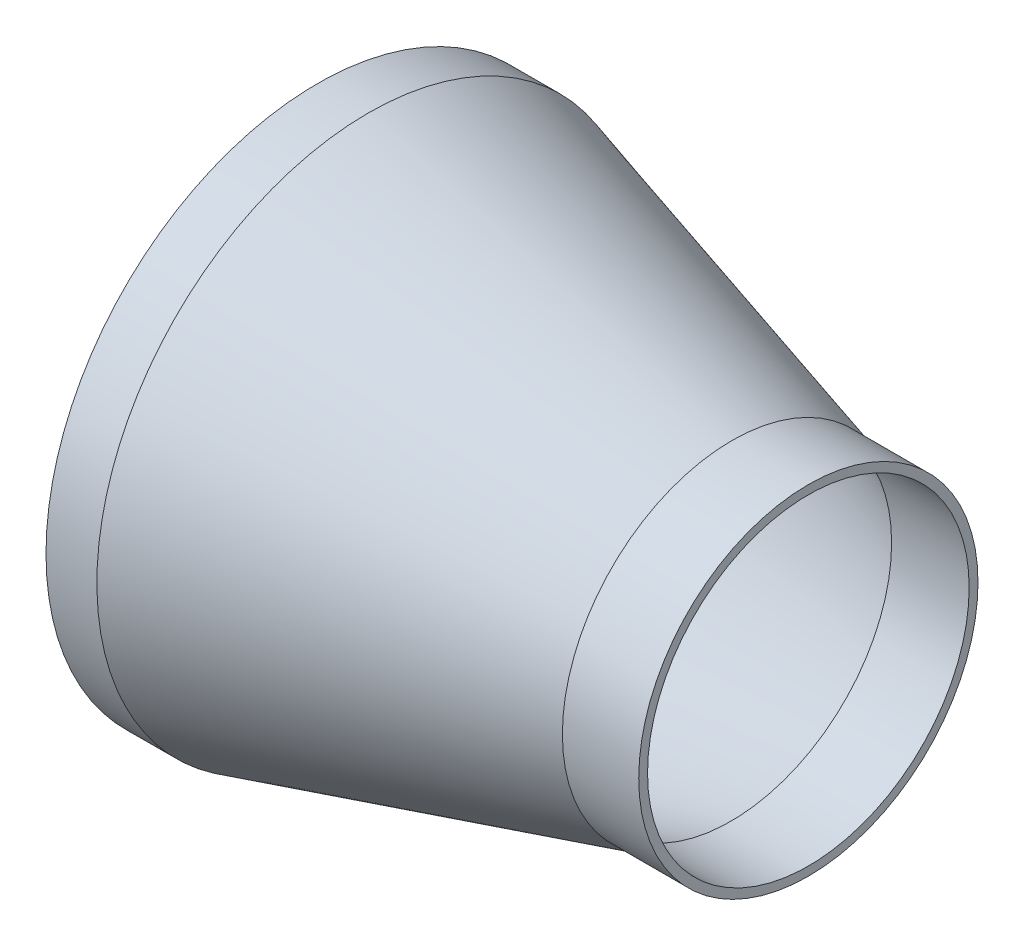
ISO-10303-21;
HEADER;
FILE_DESCRIPTION(('STEP AP214'),'2;1');
FILE_NAME('part.step','',(''),(''),'','','');
FILE_SCHEMA(('AUTOMOTIVE_DESIGN { 1 0 10303 214 1 1 1 1 }'));
ENDSEC;
DATA;
#1=APPLICATION_CONTEXT('core data for automotive mechanical design processes');
#2=APPLICATION_PROTOCOL_DEFINITION('international standard','automotive_design',2000,#1);
#3=PRODUCT_CONTEXT('',#1,'mechanical');
#4=PRODUCT('Part','Part','',(#3));
#5=PRODUCT_RELATED_PRODUCT_CATEGORY('part','',(#4));
#6=PRODUCT_DEFINITION_FORMATION('','',#4);
#7=PRODUCT_DEFINITION_CONTEXT('part definition',#1,'design');
#8=PRODUCT_DEFINITION('design','',#6,#7);
#9=PRODUCT_DEFINITION_SHAPE('','',#8);
#10=(LENGTH_UNIT() NAMED_UNIT(*) SI_UNIT(.MILLI.,.METRE.));
#11=(NAMED_UNIT(*) PLANE_ANGLE_UNIT() SI_UNIT($,.RADIAN.));
#12=(NAMED_UNIT(*) SI_UNIT($,.STERADIAN.) SOLID_ANGLE_UNIT());
#13=UNCERTAINTY_MEASURE_WITH_UNIT(LENGTH_MEASURE(1.E-05),#10,'distance_accuracy_value','');
#14=(GEOMETRIC_REPRESENTATION_CONTEXT(3) GLOBAL_UNCERTAINTY_ASSIGNED_CONTEXT((#13)) GLOBAL_UNIT_ASSIGNED_CONTEXT((#10,
#11,#12)) REPRESENTATION_CONTEXT('',''));
#15=CARTESIAN_POINT('',(0.,0.,0.));
#16=DIRECTION('',(0.,0.,1.));
#17=DIRECTION('',(1.,0.,0.));
#18=AXIS2_PLACEMENT_3D('',#15,#16,#17);
#19=CARTESIAN_POINT('',(9.29833741298526,0.,0.));
#20=DIRECTION('',(-1.,0.,0.));
#21=DIRECTION('',(0.,0.,1.));
#22=AXIS2_PLACEMENT_3D('',#19,#20,#21);
#23=CONICAL_SURFACE('',#22,49.1489999893876,0.272870294471297);
#24=CARTESIAN_POINT('',(77.3703374159551,0.,0.));
#25=DIRECTION('',(1.,0.,0.));
#26=DIRECTION('',(0.,0.,-1.));
#27=AXIS2_PLACEMENT_3D('',#24,#25,#26);
#28=CIRCLE('',#27,30.099);
#29=CARTESIAN_POINT('',(77.3703374159551,0.,-30.099));
#30=VERTEX_POINT('',#29);
#31=EDGE_CURVE('E37',#30,#30,#28,.T.);
#32=ORIENTED_EDGE('',*,*,#31,.T.);
#33=EDGE_LOOP('',(#32));
#34=FACE_BOUND('',#33,.T.);
#35=CARTESIAN_POINT('',(9.29833741595518,0.,0.));
#36=DIRECTION('',(1.,0.,0.));
#37=DIRECTION('',(0.,0.,-1.));
#38=AXIS2_PLACEMENT_3D('',#35,#36,#37);
#39=CIRCLE('',#38,49.149);
#40=CARTESIAN_POINT('',(9.29833741595518,0.,-49.149));
#41=VERTEX_POINT('',#40);
#42=EDGE_CURVE('E34',#41,#41,#39,.F.);
#43=ORIENTED_EDGE('',*,*,#42,.T.);
#44=EDGE_LOOP('',(#43));
#45=FACE_BOUND('',#44,.T.);
#46=ADVANCED_FACE('F15',(#34,#45),#23,.F.);
#47=CARTESIAN_POINT('',(84.6274187079776,0.,0.));
#48=DIRECTION('',(1.,0.,0.));
#49=DIRECTION('',(0.,0.,-1.));
#50=AXIS2_PLACEMENT_3D('',#47,#48,#49);
#51=CYLINDRICAL_SURFACE('',#50,30.099);
#52=CARTESIAN_POINT('',(91.8845000000002,0.,0.));
#53=DIRECTION('',(1.,0.,0.));
#54=DIRECTION('',(0.,0.,-1.));
#55=AXIS2_PLACEMENT_3D('',#52,#53,#54);
#56=CIRCLE('',#55,30.099);
#57=CARTESIAN_POINT('',(91.8845000000002,0.,-30.099));
#58=VERTEX_POINT('',#57);
#59=EDGE_CURVE('E18',#58,#58,#56,.F.);
#60=ORIENTED_EDGE('',*,*,#59,.F.);
#61=EDGE_LOOP('',(#60));
#62=FACE_BOUND('',#61,.T.);
#63=ORIENTED_EDGE('',*,*,#31,.F.);
#64=EDGE_LOOP('',(#63));
#65=FACE_BOUND('',#64,.T.);
#66=ADVANCED_FACE('F58',(#62,#65),#51,.F.);
#67=CARTESIAN_POINT('',(4.64916870797777,0.,0.));
#68=DIRECTION('',(1.,0.,0.));
#69=DIRECTION('',(0.,0.,-1.));
#70=AXIS2_PLACEMENT_3D('',#67,#68,#69);
#71=CYLINDRICAL_SURFACE('',#70,49.149);
#72=ORIENTED_EDGE('',*,*,#42,.F.);
#73=EDGE_LOOP('',(#72));
#74=FACE_BOUND('',#73,.T.);
#75=CARTESIAN_POINT('',(3.49546780409327E-13,0.,0.));
#76=DIRECTION('',(1.,0.,0.));
#77=DIRECTION('',(0.,0.,-1.));
#78=AXIS2_PLACEMENT_3D('',#75,#76,#77);
#79=CIRCLE('',#78,49.149);
#80=CARTESIAN_POINT('',(3.49546780409327E-13,0.,-49.149));
#81=VERTEX_POINT('',#80);
#82=EDGE_CURVE('E48',#81,#81,#79,.T.);
#83=ORIENTED_EDGE('',*,*,#82,.F.);
#84=EDGE_LOOP('',(#83));
#85=FACE_BOUND('',#84,.T.);
#86=ADVANCED_FACE('F61',(#74,#85),#71,.F.);
#87=CARTESIAN_POINT('',(91.8845000000002,30.9245,0.));
#88=DIRECTION('',(1.,0.,0.));
#89=DIRECTION('',(0.,0.,-1.));
#90=AXIS2_PLACEMENT_3D('',#87,#88,#89);
#91=PLANE('',#90);
#92=ORIENTED_EDGE('',*,*,#59,.T.);
#93=EDGE_LOOP('',(#92));
#94=FACE_BOUND('',#93,.T.);
#95=CARTESIAN_POINT('',(91.8845000000002,0.,0.));
#96=DIRECTION('',(1.,0.,0.));
#97=DIRECTION('',(0.,0.,-1.));
#98=AXIS2_PLACEMENT_3D('',#95,#96,#97);
#99=CIRCLE('',#98,31.75);
#100=CARTESIAN_POINT('',(91.8845000000002,0.,-31.75));
#101=VERTEX_POINT('',#100);
#102=EDGE_CURVE('E46',#101,#101,#99,.F.);
#103=ORIENTED_EDGE('',*,*,#102,.F.);
#104=EDGE_LOOP('',(#103));
#105=FACE_BOUND('',#104,.T.);
#106=ADVANCED_FACE('F55',(#94,#105),#91,.T.);
#107=CARTESIAN_POINT('',(3.49675958E-13,49.9745,0.));
#108=DIRECTION('',(-1.,0.,0.));
#109=DIRECTION('',(0.,0.,1.));
#110=AXIS2_PLACEMENT_3D('',#107,#108,#109);
#111=PLANE('',#110);
#112=ORIENTED_EDGE('',*,*,#82,.T.);
#113=EDGE_LOOP('',(#112));
#114=FACE_BOUND('',#113,.T.);
#115=CARTESIAN_POINT('',(3.49546780409327E-13,0.,0.));
#116=DIRECTION('',(1.,0.,0.));
#117=DIRECTION('',(0.,0.,-1.));
#118=AXIS2_PLACEMENT_3D('',#115,#116,#117);
#119=CIRCLE('',#118,50.8);
#120=CARTESIAN_POINT('',(3.49546780409327E-13,0.,-50.8));
#121=VERTEX_POINT('',#120);
#122=EDGE_CURVE('E27',#121,#121,#119,.T.);
#123=ORIENTED_EDGE('',*,*,#122,.F.);
#124=EDGE_LOOP('',(#123));
#125=FACE_BOUND('',#124,.T.);
#126=ADVANCED_FACE('F75',(#114,#125),#111,.T.);
#127=CARTESIAN_POINT('',(84.7407500000002,0.,0.));
#128=DIRECTION('',(1.,0.,0.));
#129=DIRECTION('',(0.,0.,-1.));
#130=AXIS2_PLACEMENT_3D('',#127,#128,#129);
#131=CYLINDRICAL_SURFACE('',#130,31.75);
#132=CARTESIAN_POINT('',(77.5970000029701,0.,0.));
#133=DIRECTION('',(-1.,0.,0.));
#134=DIRECTION('',(0.,1.,0.));
#135=AXIS2_PLACEMENT_3D('',#132,#133,#134);
#136=CIRCLE('',#135,31.7500000106124);
#137=CARTESIAN_POINT('',(77.5970000029701,31.7500000106124,0.));
#138=VERTEX_POINT('',#137);
#139=EDGE_CURVE('E22',#138,#138,#136,.T.);
#140=ORIENTED_EDGE('',*,*,#139,.F.);
#141=EDGE_LOOP('',(#140));
#142=FACE_BOUND('',#141,.T.);
#143=ORIENTED_EDGE('',*,*,#102,.T.);
#144=EDGE_LOOP('',(#143));
#145=FACE_BOUND('',#144,.T.);
#146=ADVANCED_FACE('F84',(#142,#145),#131,.T.);
#147=CARTESIAN_POINT('',(4.76250000000036,0.,0.));
#148=DIRECTION('',(1.,0.,0.));
#149=DIRECTION('',(0.,0.,-1.));
#150=AXIS2_PLACEMENT_3D('',#147,#148,#149);
#151=CYLINDRICAL_SURFACE('',#150,50.8);
#152=ORIENTED_EDGE('',*,*,#122,.T.);
#153=EDGE_LOOP('',(#152));
#154=FACE_BOUND('',#153,.T.);
#155=CARTESIAN_POINT('',(9.52499999703049,0.,0.));
#156=DIRECTION('',(-1.,0.,0.));
#157=DIRECTION('',(0.,1.,0.));
#158=AXIS2_PLACEMENT_3D('',#155,#156,#157);
#159=CIRCLE('',#158,50.7999999893876);
#160=CARTESIAN_POINT('',(9.52499999703049,50.7999999893876,0.));
#161=VERTEX_POINT('',#160);
#162=EDGE_CURVE('E10',#161,#161,#159,.F.);
#163=ORIENTED_EDGE('',*,*,#162,.F.);
#164=EDGE_LOOP('',(#163));
#165=FACE_BOUND('',#164,.T.);
#166=ADVANCED_FACE('F79',(#154,#165),#151,.T.);
#167=CARTESIAN_POINT('',(9.52499999703049,0.,0.));
#168=DIRECTION('',(-1.,0.,0.));
#169=DIRECTION('',(0.,0.,1.));
#170=AXIS2_PLACEMENT_3D('',#167,#168,#169);
#171=CONICAL_SURFACE('',#170,50.7999999893876,0.272870294471296);
#172=ORIENTED_EDGE('',*,*,#162,.T.);
#173=EDGE_LOOP('',(#172));
#174=FACE_BOUND('',#173,.T.);
#175=ORIENTED_EDGE('',*,*,#139,.T.);
#176=EDGE_LOOP('',(#175));
#177=FACE_BOUND('',#176,.T.);
#178=ADVANCED_FACE('F77',(#174,#177),#171,.T.);
#179=CLOSED_SHELL('',(#46,#66,#86,#106,#126,#146,#166,#178));
#180=MANIFOLD_SOLID_BREP('B1',#179);
#181=ADVANCED_BREP_SHAPE_REPRESENTATION('',(#18,#180),#14);
#182=SHAPE_DEFINITION_REPRESENTATION(#9,#181);
ENDSEC;
END-ISO-10303-21;
